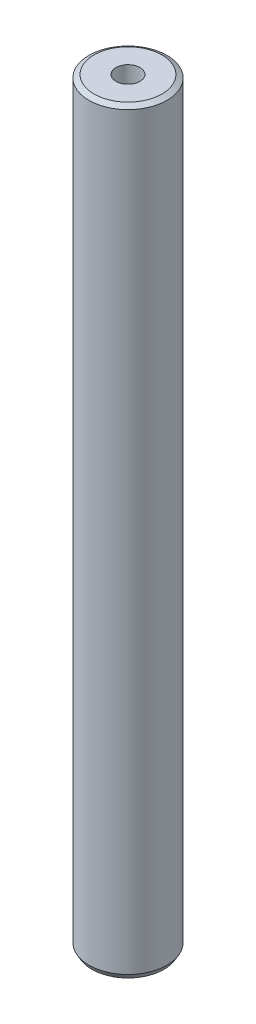
ISO-10303-21;
HEADER;
FILE_DESCRIPTION(('STEP AP214'),'2;1');
FILE_NAME('part.step','',(''),(''),'','','');
FILE_SCHEMA(('AUTOMOTIVE_DESIGN { 1 0 10303 214 1 1 1 1 }'));
ENDSEC;
DATA;
#1=APPLICATION_CONTEXT('core data for automotive mechanical design processes');
#2=APPLICATION_PROTOCOL_DEFINITION('international standard','automotive_design',2000,#1);
#3=PRODUCT_CONTEXT('',#1,'mechanical');
#4=PRODUCT('Part','Part','',(#3));
#5=PRODUCT_RELATED_PRODUCT_CATEGORY('part','',(#4));
#6=PRODUCT_DEFINITION_FORMATION('','',#4);
#7=PRODUCT_DEFINITION_CONTEXT('part definition',#1,'design');
#8=PRODUCT_DEFINITION('design','',#6,#7);
#9=PRODUCT_DEFINITION_SHAPE('','',#8);
#10=(LENGTH_UNIT() NAMED_UNIT(*) SI_UNIT(.MILLI.,.METRE.));
#11=(NAMED_UNIT(*) PLANE_ANGLE_UNIT() SI_UNIT($,.RADIAN.));
#12=(NAMED_UNIT(*) SI_UNIT($,.STERADIAN.) SOLID_ANGLE_UNIT());
#13=UNCERTAINTY_MEASURE_WITH_UNIT(LENGTH_MEASURE(1.E-05),#10,'distance_accuracy_value','');
#14=(GEOMETRIC_REPRESENTATION_CONTEXT(3) GLOBAL_UNCERTAINTY_ASSIGNED_CONTEXT((#13)) GLOBAL_UNIT_ASSIGNED_CONTEXT((#10,
#11,#12)) REPRESENTATION_CONTEXT('',''));
#15=CARTESIAN_POINT('',(0.,0.,0.));
#16=DIRECTION('',(0.,0.,1.));
#17=DIRECTION('',(1.,0.,0.));
#18=AXIS2_PLACEMENT_3D('',#15,#16,#17);
#19=CARTESIAN_POINT('',(0.,388.158257927642,0.));
#20=DIRECTION('',(0.,-1.,0.));
#21=DIRECTION('',(0.,0.,-1.));
#22=AXIS2_PLACEMENT_3D('',#19,#20,#21);
#23=CYLINDRICAL_SURFACE('',#22,20.);
#24=CARTESIAN_POINT('',(0.,386.652696872793,0.));
#25=DIRECTION('',(0.,1.,0.));
#26=DIRECTION('',(0.,0.,1.));
#27=AXIS2_PLACEMENT_3D('',#24,#25,#26);
#28=CIRCLE('',#27,20.);
#29=CARTESIAN_POINT('',(0.,386.652696872793,20.));
#30=VERTEX_POINT('',#29);
#31=EDGE_CURVE('E50',#30,#30,#28,.F.);
#32=ORIENTED_EDGE('',*,*,#31,.T.);
#33=EDGE_LOOP('',(#32));
#34=FACE_BOUND('',#33,.T.);
#35=CARTESIAN_POINT('',(0.,2.60770824089535,0.));
#36=DIRECTION('',(0.,1.,0.));
#37=DIRECTION('',(0.,0.,1.));
#38=AXIS2_PLACEMENT_3D('',#35,#36,#37);
#39=CIRCLE('',#38,20.);
#40=CARTESIAN_POINT('',(0.,2.60770824089535,20.));
#41=VERTEX_POINT('',#40);
#42=EDGE_CURVE('E51',#41,#41,#39,.T.);
#43=ORIENTED_EDGE('',*,*,#42,.T.);
#44=EDGE_LOOP('',(#43));
#45=FACE_BOUND('',#44,.T.);
#46=ADVANCED_FACE('F39',(#34,#45),#23,.T.);
#47=CARTESIAN_POINT('',(0.,388.158257927642,0.));
#48=DIRECTION('',(0.,1.,0.));
#49=DIRECTION('',(0.,0.,1.));
#50=AXIS2_PLACEMENT_3D('',#47,#48,#49);
#51=PLANE('',#50);
#52=CARTESIAN_POINT('',(0.,388.158257927642,0.));
#53=DIRECTION('',(0.,1.,0.));
#54=DIRECTION('',(0.,0.,1.));
#55=AXIS2_PLACEMENT_3D('',#52,#53,#54);
#56=CIRCLE('',#55,17.3922917591047);
#57=CARTESIAN_POINT('',(0.,388.158257927642,17.3922917591047));
#58=VERTEX_POINT('',#57);
#59=EDGE_CURVE('E54',#58,#58,#56,.T.);
#60=ORIENTED_EDGE('',*,*,#59,.T.);
#61=EDGE_LOOP('',(#60));
#62=FACE_BOUND('',#61,.T.);
#63=CARTESIAN_POINT('',(0.,388.158257927642,0.));
#64=DIRECTION('',(0.,1.,0.));
#65=DIRECTION('',(0.,0.,1.));
#66=AXIS2_PLACEMENT_3D('',#63,#64,#65);
#67=CIRCLE('',#66,6.15050318421818);
#68=CARTESIAN_POINT('',(0.,388.158257927642,6.15050318421818));
#69=VERTEX_POINT('',#68);
#70=EDGE_CURVE('E58',#69,#69,#67,.T.);
#71=ORIENTED_EDGE('',*,*,#70,.F.);
#72=EDGE_LOOP('',(#71));
#73=FACE_BOUND('',#72,.T.);
#74=ADVANCED_FACE('F69',(#62,#73),#51,.T.);
#75=CARTESIAN_POINT('',(0.,0.,0.));
#76=DIRECTION('',(0.,1.,0.));
#77=DIRECTION('',(0.,0.,1.));
#78=AXIS2_PLACEMENT_3D('',#75,#76,#77);
#79=PLANE('',#78);
#80=CARTESIAN_POINT('',(0.,0.,0.));
#81=DIRECTION('',(0.,1.,0.));
#82=DIRECTION('',(0.,0.,1.));
#83=AXIS2_PLACEMENT_3D('',#80,#81,#82);
#84=CIRCLE('',#83,18.4944389451511);
#85=CARTESIAN_POINT('',(0.,0.,18.4944389451511));
#86=VERTEX_POINT('',#85);
#87=EDGE_CURVE('E10',#86,#86,#84,.F.);
#88=ORIENTED_EDGE('',*,*,#87,.T.);
#89=EDGE_LOOP('',(#88));
#90=FACE_BOUND('',#89,.T.);
#91=CARTESIAN_POINT('',(0.,0.,0.));
#92=DIRECTION('',(0.,1.,0.));
#93=DIRECTION('',(0.,0.,1.));
#94=AXIS2_PLACEMENT_3D('',#91,#92,#93);
#95=CIRCLE('',#94,6.15050318421818);
#96=CARTESIAN_POINT('',(0.,0.,6.15050318421818));
#97=VERTEX_POINT('',#96);
#98=EDGE_CURVE('E63',#97,#97,#95,.T.);
#99=ORIENTED_EDGE('',*,*,#98,.T.);
#100=EDGE_LOOP('',(#99));
#101=FACE_BOUND('',#100,.T.);
#102=ADVANCED_FACE('F75',(#90,#101),#79,.F.);
#103=CARTESIAN_POINT('',(0.,388.158257927642,0.));
#104=DIRECTION('',(0.,-1.,0.));
#105=DIRECTION('',(0.,0.,-1.));
#106=AXIS2_PLACEMENT_3D('',#103,#104,#105);
#107=CYLINDRICAL_SURFACE('',#106,6.15050318421818);
#108=ORIENTED_EDGE('',*,*,#70,.T.);
#109=EDGE_LOOP('',(#108));
#110=FACE_BOUND('',#109,.T.);
#111=ORIENTED_EDGE('',*,*,#98,.F.);
#112=EDGE_LOOP('',(#111));
#113=FACE_BOUND('',#112,.T.);
#114=ADVANCED_FACE('F70',(#110,#113),#107,.F.);
#115=CARTESIAN_POINT('',(0.,388.158257927642,0.));
#116=DIRECTION('',(0.,-1.,0.));
#117=DIRECTION('',(0.,0.,-1.));
#118=AXIS2_PLACEMENT_3D('',#115,#116,#117);
#119=CONICAL_SURFACE('',#118,17.3922917591047,1.04719755119658);
#120=ORIENTED_EDGE('',*,*,#31,.F.);
#121=EDGE_LOOP('',(#120));
#122=FACE_BOUND('',#121,.T.);
#123=ORIENTED_EDGE('',*,*,#59,.F.);
#124=EDGE_LOOP('',(#123));
#125=FACE_BOUND('',#124,.T.);
#126=ADVANCED_FACE('F81',(#122,#125),#119,.T.);
#127=CARTESIAN_POINT('',(0.,2.60770824089535,0.));
#128=DIRECTION('',(0.,1.,0.));
#129=DIRECTION('',(0.,0.,1.));
#130=AXIS2_PLACEMENT_3D('',#127,#128,#129);
#131=CONICAL_SURFACE('',#130,20.,0.523598775598298);
#132=CARTESIAN_POINT('',(0.,0.,18.4944389451511));
#133=CARTESIAN_POINT('',(0.,0.0271636275093268,18.5101218728057));
#134=CARTESIAN_POINT('',(0.,0.0543272550186531,18.5258048004604));
#135=CARTESIAN_POINT('',(0.,0.108654510037306,18.5571706557698));
#136=CARTESIAN_POINT('',(0.,0.135818137546632,18.5728535834245));
#137=CARTESIAN_POINT('',(0.,0.190145392565285,18.6042194387338));
#138=CARTESIAN_POINT('',(0.,0.217309020074612,18.6199023663885));
#139=CARTESIAN_POINT('',(0.,0.271636275093265,18.6512682216978));
#140=CARTESIAN_POINT('',(0.,0.298799902602592,18.6669511493525));
#141=CARTESIAN_POINT('',(0.,0.353127157621244,18.6983170046619));
#142=CARTESIAN_POINT('',(0.,0.380290785130571,18.7139999323165));
#143=CARTESIAN_POINT('',(0.,0.434618040149223,18.7453657876259));
#144=CARTESIAN_POINT('',(0.,0.46178166765855,18.7610487152806));
#145=CARTESIAN_POINT('',(0.,0.516108922677204,18.7924145705899));
#146=CARTESIAN_POINT('',(0.,0.54327255018653,18.8080974982446));
#147=CARTESIAN_POINT('',(0.,0.597599805205183,18.8394633535539));
#148=CARTESIAN_POINT('',(0.,0.624763432714509,18.8551462812086));
#149=CARTESIAN_POINT('',(0.,0.679090687733162,18.886512136518));
#150=CARTESIAN_POINT('',(0.,0.706254315242489,18.9021950641727));
#151=CARTESIAN_POINT('',(0.,0.760581570261142,18.933560919482));
#152=CARTESIAN_POINT('',(0.,0.787745197770469,18.9492438471367));
#153=CARTESIAN_POINT('',(0.,0.842072452789122,18.980609702446));
#154=CARTESIAN_POINT('',(0.,0.869236080298448,18.9962926301007));
#155=CARTESIAN_POINT('',(0.,0.923563335317101,19.0276584854101));
#156=CARTESIAN_POINT('',(0.,0.950726962826428,19.0433414130647));
#157=CARTESIAN_POINT('',(0.,1.00505421784508,19.0747072683741));
#158=CARTESIAN_POINT('',(0.,1.03221784535441,19.0903901960288));
#159=CARTESIAN_POINT('',(0.,1.08654510037306,19.1217560513381));
#160=CARTESIAN_POINT('',(0.,1.11370872788239,19.1374389789928));
#161=CARTESIAN_POINT('',(0.,1.16803598290104,19.1688048343022));
#162=CARTESIAN_POINT('',(0.,1.19519961041037,19.1844877619568));
#163=CARTESIAN_POINT('',(0.,1.24952686542902,19.2158536172662));
#164=CARTESIAN_POINT('',(0.,1.27669049293835,19.2315365449209));
#165=CARTESIAN_POINT('',(0.,1.331017747957,19.2629024002302));
#166=CARTESIAN_POINT('',(0.,1.35818137546633,19.2785853278849));
#167=CARTESIAN_POINT('',(0.,1.41250863048498,19.3099511831942));
#168=CARTESIAN_POINT('',(0.,1.43967225799431,19.3256341108489));
#169=CARTESIAN_POINT('',(0.,1.49399951301296,19.3569999661583));
#170=CARTESIAN_POINT('',(0.,1.52116314052228,19.3726828938129));
#171=CARTESIAN_POINT('',(0.,1.57549039554094,19.4040487491223));
#172=CARTESIAN_POINT('',(0.,1.60265402305026,19.419731676777));
#173=CARTESIAN_POINT('',(0.,1.65698127806892,19.4510975320863));
#174=CARTESIAN_POINT('',(0.,1.68414490557824,19.466780459741));
#175=CARTESIAN_POINT('',(0.,1.7384721605969,19.4981463150504));
#176=CARTESIAN_POINT('',(0.,1.76563578810622,19.513829242705));
#177=CARTESIAN_POINT('',(0.,1.81996304312488,19.5451950980144));
#178=CARTESIAN_POINT('',(0.,1.8471266706342,19.5608780256691));
#179=CARTESIAN_POINT('',(0.,1.90145392565286,19.5922438809784));
#180=CARTESIAN_POINT('',(0.,1.92861755316218,19.6079268086331));
#181=CARTESIAN_POINT('',(0.,1.98294480818084,19.6392926639424));
#182=CARTESIAN_POINT('',(0.,2.01010843569016,19.6549755915971));
#183=CARTESIAN_POINT('',(0.,2.06443569070882,19.6863414469065));
#184=CARTESIAN_POINT('',(0.,2.09159931821814,19.7020243745612));
#185=CARTESIAN_POINT('',(0.,2.1459265732368,19.7333902298705));
#186=CARTESIAN_POINT('',(0.,2.17309020074612,19.7490731575252));
#187=CARTESIAN_POINT('',(0.,2.22741745576477,19.7804390128345));
#188=CARTESIAN_POINT('',(0.,2.2545810832741,19.7961219404892));
#189=CARTESIAN_POINT('',(0.,2.30890833829275,19.8274877957986));
#190=CARTESIAN_POINT('',(0.,2.33607196580208,19.8431707234532));
#191=CARTESIAN_POINT('',(0.,2.39039922082073,19.8745365787626));
#192=CARTESIAN_POINT('',(0.,2.41756284833006,19.8902195064173));
#193=CARTESIAN_POINT('',(0.,2.47189010334871,19.9215853617266));
#194=CARTESIAN_POINT('',(0.,2.49905373085804,19.9372682893813));
#195=CARTESIAN_POINT('',(0.,2.55338098587669,19.9686341446907));
#196=CARTESIAN_POINT('',(0.,2.58054461338602,19.9843170723453));
#197=CARTESIAN_POINT('',(0.,2.60770824089535,20.));
#198=B_SPLINE_CURVE_WITH_KNOTS('',3,(#132,#133,#134,#135,#136,#137,#138,#139,#140,#141,#142,
#143,#144,#145,#146,#147,#148,#149,#150,#151,#152,#153,#154,#155,#156,#157,#158,#159,#160,#161,
#162,#163,#164,#165,#166,#167,#168,#169,#170,#171,#172,#173,#174,#175,#176,#177,#178,#179,#180,
#181,#182,#183,#184,#185,#186,#187,#188,#189,#190,#191,#192,#193,#194,#195,#196,#197),
.UNSPECIFIED.,.F.,.F.,(4,2,2,2,2,2,2,2,2,2,2,2,2,2,2,2,2,2,2,2,2,2,2,2,2,2,2,2,2,2,2,2,4),(0.,
0.0940975659280577,0.188195131856117,0.282292697784175,0.376390263712232,0.470487829640292,
0.56458539556835,0.658682961496407,0.752780527424467,0.846878093352524,0.940975659280582,
1.03507322520864,1.1291707911367,1.22326835706476,1.31736592299282,1.41146348892087,
1.50556105484893,1.59965862077699,1.69375618670505,1.78785375263311,1.88195131856117,
1.97604888448922,2.07014645041728,2.16424401634534,2.2583415822734,2.35243914820146,
2.44653671412951,2.54063428005757,2.63473184598563,2.72882941191369,2.82292697784175,
2.91702454376981,3.01112210969786),.UNSPECIFIED.);
#199=EDGE_CURVE('BSEAM45',#86,#41,#198,.T.);
#200=ORIENTED_EDGE('',*,*,#87,.F.);
#201=ORIENTED_EDGE('',*,*,#42,.F.);
#202=ORIENTED_EDGE('',*,*,#199,.T.);
#203=ORIENTED_EDGE('',*,*,#199,.F.);
#204=EDGE_LOOP('',(#200,#202,#201,#203));
#205=FACE_BOUND('',#204,.T.);
#206=ADVANCED_FACE('F45',(#205),#131,.T.);
#207=CLOSED_SHELL('',(#46,#74,#102,#114,#126,#206));
#208=MANIFOLD_SOLID_BREP('B2',#207);
#209=ADVANCED_BREP_SHAPE_REPRESENTATION('',(#18,#208),#14);
#210=SHAPE_DEFINITION_REPRESENTATION(#9,#209);
ENDSEC;
END-ISO-10303-21;
